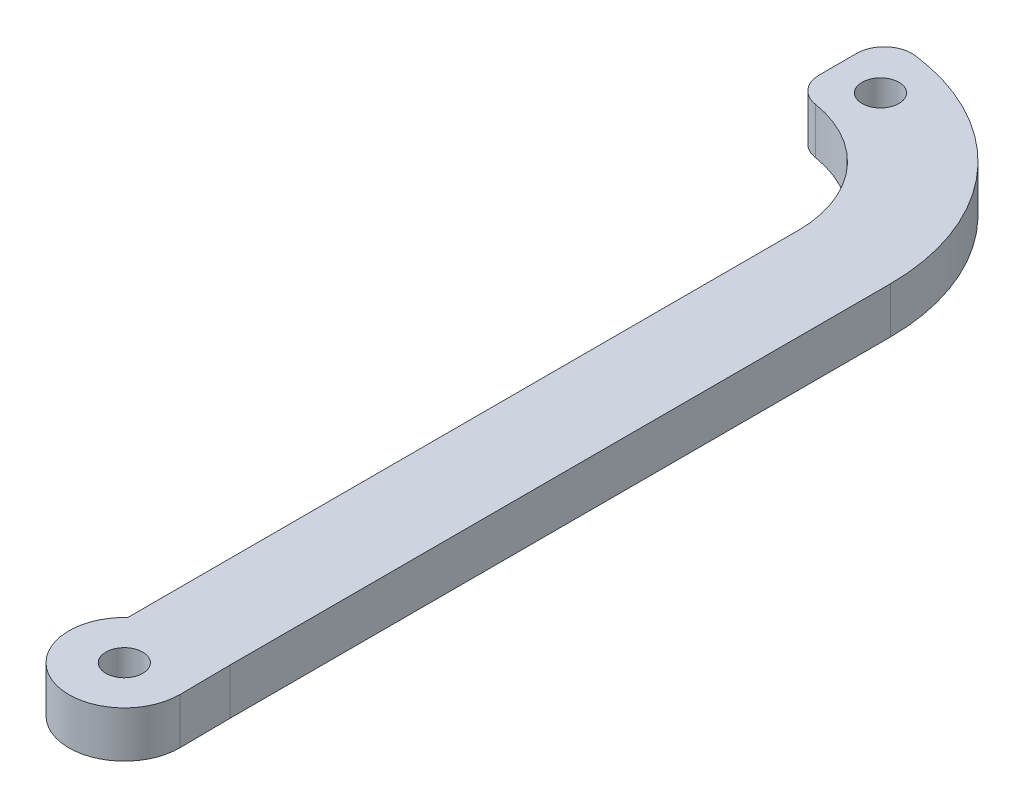
ISO-10303-21;
HEADER;
FILE_DESCRIPTION(('STEP AP214'),'2;1');
FILE_NAME('part.step','',(''),(''),'','','');
FILE_SCHEMA(('AUTOMOTIVE_DESIGN { 1 0 10303 214 1 1 1 1 }'));
ENDSEC;
DATA;
#1=APPLICATION_CONTEXT('core data for automotive mechanical design processes');
#2=APPLICATION_PROTOCOL_DEFINITION('international standard','automotive_design',2000,#1);
#3=PRODUCT_CONTEXT('',#1,'mechanical');
#4=PRODUCT('Part','Part','',(#3));
#5=PRODUCT_RELATED_PRODUCT_CATEGORY('part','',(#4));
#6=PRODUCT_DEFINITION_FORMATION('','',#4);
#7=PRODUCT_DEFINITION_CONTEXT('part definition',#1,'design');
#8=PRODUCT_DEFINITION('design','',#6,#7);
#9=PRODUCT_DEFINITION_SHAPE('','',#8);
#10=(LENGTH_UNIT() NAMED_UNIT(*) SI_UNIT(.MILLI.,.METRE.));
#11=(NAMED_UNIT(*) PLANE_ANGLE_UNIT() SI_UNIT($,.RADIAN.));
#12=(NAMED_UNIT(*) SI_UNIT($,.STERADIAN.) SOLID_ANGLE_UNIT());
#13=UNCERTAINTY_MEASURE_WITH_UNIT(LENGTH_MEASURE(1.E-05),#10,'distance_accuracy_value','');
#14=(GEOMETRIC_REPRESENTATION_CONTEXT(3) GLOBAL_UNCERTAINTY_ASSIGNED_CONTEXT((#13)) GLOBAL_UNIT_ASSIGNED_CONTEXT((#10,
#11,#12)) REPRESENTATION_CONTEXT('',''));
#15=CARTESIAN_POINT('',(0.,0.,0.));
#16=DIRECTION('',(0.,0.,1.));
#17=DIRECTION('',(1.,0.,0.));
#18=AXIS2_PLACEMENT_3D('',#15,#16,#17);
#19=CARTESIAN_POINT('',(-17.,5.,-49.1131525975226));
#20=DIRECTION('',(0.,-1.,0.));
#21=DIRECTION('',(0.,0.,-1.));
#22=AXIS2_PLACEMENT_3D('',#19,#20,#21);
#23=CYLINDRICAL_SURFACE('',#22,22.945);
#24=CARTESIAN_POINT('',(-17.,0.,-49.1131525975226));
#25=DIRECTION('',(0.,1.,0.));
#26=DIRECTION('',(0.,0.,1.));
#27=AXIS2_PLACEMENT_3D('',#24,#25,#26);
#28=CIRCLE('',#27,22.945);
#29=CARTESIAN_POINT('',(-14.1239659062422,0.,-71.8771911867435));
#30=VERTEX_POINT('',#29);
#31=CARTESIAN_POINT('',(5.94499999999996,0.,-49.1131525975226));
#32=VERTEX_POINT('',#31);
#33=EDGE_CURVE('E149',#30,#32,#28,.F.);
#34=ORIENTED_EDGE('',*,*,#33,.F.);
#35=DIRECTION('',(0.,-1.,0.));
#36=VECTOR('',#35,1.);
#37=CARTESIAN_POINT('',(-14.1239659062422,5.,-71.8771911867436));
#38=LINE('',#37,#36);
#39=CARTESIAN_POINT('',(-14.1239659062422,5.,-71.8771911867435));
#40=VERTEX_POINT('',#39);
#41=EDGE_CURVE('E11',#30,#40,#38,.F.);
#42=ORIENTED_EDGE('',*,*,#41,.T.);
#43=CARTESIAN_POINT('',(-17.,5.,-49.1131525975226));
#44=DIRECTION('',(0.,1.,0.));
#45=DIRECTION('',(0.,0.,1.));
#46=AXIS2_PLACEMENT_3D('',#43,#44,#45);
#47=CIRCLE('',#46,22.945);
#48=CARTESIAN_POINT('',(5.94499999999996,5.,-49.1131525975226));
#49=VERTEX_POINT('',#48);
#50=EDGE_CURVE('E171',#40,#49,#47,.F.);
#51=ORIENTED_EDGE('',*,*,#50,.T.);
#52=DIRECTION('',(0.,-1.,0.));
#53=VECTOR('',#52,1.);
#54=CARTESIAN_POINT('',(5.94499999999996,5.,-49.1131525975226));
#55=LINE('',#54,#53);
#56=EDGE_CURVE('E148',#49,#32,#55,.T.);
#57=ORIENTED_EDGE('',*,*,#56,.T.);
#58=EDGE_LOOP('',(#34,#42,#51,#57));
#59=FACE_BOUND('',#58,.T.);
#60=ADVANCED_FACE('F34',(#59),#23,.T.);
#61=CARTESIAN_POINT('',(-17.5,5.,0.));
#62=DIRECTION('',(1.,0.,0.));
#63=DIRECTION('',(0.,0.,-1.));
#64=AXIS2_PLACEMENT_3D('',#61,#62,#63);
#65=PLANE('',#64);
#66=DIRECTION('',(0.,0.,1.));
#67=VECTOR('',#66,1.);
#68=CARTESIAN_POINT('',(-17.5,0.,0.));
#69=LINE('',#68,#67);
#70=CARTESIAN_POINT('',(-17.5,0.,-68.9008514278565));
#71=VERTEX_POINT('',#70);
#72=CARTESIAN_POINT('',(-17.5,0.,-64.8609468875176));
#73=VERTEX_POINT('',#72);
#74=EDGE_CURVE('E151',#71,#73,#69,.T.);
#75=ORIENTED_EDGE('',*,*,#74,.T.);
#76=DIRECTION('',(0.,-1.,0.));
#77=VECTOR('',#76,1.);
#78=CARTESIAN_POINT('',(-17.5,5.,-64.8609468875176));
#79=LINE('',#78,#77);
#80=CARTESIAN_POINT('',(-17.5,5.,-64.8609468875176));
#81=VERTEX_POINT('',#80);
#82=EDGE_CURVE('E55',#73,#81,#79,.F.);
#83=ORIENTED_EDGE('',*,*,#82,.T.);
#84=DIRECTION('',(0.,0.,1.));
#85=VECTOR('',#84,1.);
#86=CARTESIAN_POINT('',(-17.5,5.,0.));
#87=LINE('',#86,#85);
#88=CARTESIAN_POINT('',(-17.5,5.,-68.9008514278565));
#89=VERTEX_POINT('',#88);
#90=EDGE_CURVE('E116',#89,#81,#87,.T.);
#91=ORIENTED_EDGE('',*,*,#90,.F.);
#92=DIRECTION('',(0.,1.,0.));
#93=VECTOR('',#92,1.);
#94=CARTESIAN_POINT('',(-17.5,0.,-68.9008514278565));
#95=LINE('',#94,#93);
#96=EDGE_CURVE('E184',#89,#71,#95,.F.);
#97=ORIENTED_EDGE('',*,*,#96,.T.);
#98=EDGE_LOOP('',(#75,#83,#91,#97));
#99=FACE_BOUND('',#98,.T.);
#100=ADVANCED_FACE('F193',(#99),#65,.F.);
#101=CARTESIAN_POINT('',(-17.,5.,-49.1131525975225));
#102=DIRECTION('',(0.,-1.,0.));
#103=DIRECTION('',(0.,0.,-1.));
#104=AXIS2_PLACEMENT_3D('',#101,#102,#103);
#105=CYLINDRICAL_SURFACE('',#104,12.945);
#106=CARTESIAN_POINT('',(-17.,5.,-49.1131525975225));
#107=DIRECTION('',(0.,1.,0.));
#108=DIRECTION('',(0.,0.,1.));
#109=AXIS2_PLACEMENT_3D('',#106,#107,#108);
#110=CIRCLE('',#109,12.945);
#111=CARTESIAN_POINT('',(-14.9703668861712,5.,-61.8980505018177));
#112=VERTEX_POINT('',#111);
#113=CARTESIAN_POINT('',(-4.05499999999999,5.,-49.1131525975225));
#114=VERTEX_POINT('',#113);
#115=EDGE_CURVE('E106',#112,#114,#110,.F.);
#116=ORIENTED_EDGE('',*,*,#115,.F.);
#117=DIRECTION('',(0.,-1.,0.));
#118=VECTOR('',#117,1.);
#119=CARTESIAN_POINT('',(-14.9703668861712,5.,-61.8980505018177));
#120=LINE('',#119,#118);
#121=CARTESIAN_POINT('',(-14.9703668861712,0.,-61.8980505018177));
#122=VERTEX_POINT('',#121);
#123=EDGE_CURVE('E126',#112,#122,#120,.T.);
#124=ORIENTED_EDGE('',*,*,#123,.T.);
#125=CARTESIAN_POINT('',(-17.,0.,-49.1131525975225));
#126=DIRECTION('',(0.,1.,0.));
#127=DIRECTION('',(0.,0.,1.));
#128=AXIS2_PLACEMENT_3D('',#125,#126,#127);
#129=CIRCLE('',#128,12.945);
#130=CARTESIAN_POINT('',(-4.05499999999999,0.,-49.1131525975225));
#131=VERTEX_POINT('',#130);
#132=EDGE_CURVE('E122',#122,#131,#129,.F.);
#133=ORIENTED_EDGE('',*,*,#132,.T.);
#134=DIRECTION('',(0.,-1.,0.));
#135=VECTOR('',#134,1.);
#136=CARTESIAN_POINT('',(-4.05499999999999,5.,-49.1131525975225));
#137=LINE('',#136,#135);
#138=EDGE_CURVE('E119',#114,#131,#137,.T.);
#139=ORIENTED_EDGE('',*,*,#138,.F.);
#140=EDGE_LOOP('',(#116,#124,#133,#139));
#141=FACE_BOUND('',#140,.T.);
#142=ADVANCED_FACE('F120',(#141),#105,.F.);
#143=CARTESIAN_POINT('',(-4.05499999999999,5.,0.));
#144=DIRECTION('',(-1.,0.,0.));
#145=DIRECTION('',(0.,0.,1.));
#146=AXIS2_PLACEMENT_3D('',#143,#144,#145);
#147=PLANE('',#146);
#148=DIRECTION('',(0.,0.,-1.));
#149=VECTOR('',#148,1.);
#150=CARTESIAN_POINT('',(-4.05499999999999,0.,0.));
#151=LINE('',#150,#149);
#152=CARTESIAN_POINT('',(-4.05499999999999,0.,23.519927529847));
#153=VERTEX_POINT('',#152);
#154=EDGE_CURVE('E154',#153,#131,#151,.T.);
#155=ORIENTED_EDGE('',*,*,#154,.F.);
#156=DIRECTION('',(0.,-1.,0.));
#157=VECTOR('',#156,1.);
#158=CARTESIAN_POINT('',(-4.05499999999999,5.,23.519927529847));
#159=LINE('',#158,#157);
#160=CARTESIAN_POINT('',(-4.05499999999999,5.,23.519927529847));
#161=VERTEX_POINT('',#160);
#162=EDGE_CURVE('E127',#161,#153,#159,.T.);
#163=ORIENTED_EDGE('',*,*,#162,.F.);
#164=DIRECTION('',(0.,0.,-1.));
#165=VECTOR('',#164,1.);
#166=CARTESIAN_POINT('',(-4.05499999999999,5.,0.));
#167=LINE('',#166,#165);
#168=EDGE_CURVE('E111',#161,#114,#167,.T.);
#169=ORIENTED_EDGE('',*,*,#168,.T.);
#170=ORIENTED_EDGE('',*,*,#138,.T.);
#171=EDGE_LOOP('',(#155,#163,#169,#170));
#172=FACE_BOUND('',#171,.T.);
#173=ADVANCED_FACE('F129',(#172),#147,.T.);
#174=CARTESIAN_POINT('',(0.,5.,27.9418474024774));
#175=DIRECTION('',(0.,-1.,0.));
#176=DIRECTION('',(0.,0.,-1.));
#177=AXIS2_PLACEMENT_3D('',#174,#175,#176);
#178=CYLINDRICAL_SURFACE('',#177,5.99970002249813);
#179=CARTESIAN_POINT('',(0.,0.,27.9418474024774));
#180=DIRECTION('',(0.,1.,0.));
#181=DIRECTION('',(0.,0.,1.));
#182=AXIS2_PLACEMENT_3D('',#179,#180,#181);
#183=CIRCLE('',#182,5.99970002249813);
#184=CARTESIAN_POINT('',(5.999400059994,0.,27.8818534018775));
#185=VERTEX_POINT('',#184);
#186=EDGE_CURVE('E156',#153,#185,#183,.T.);
#187=ORIENTED_EDGE('',*,*,#186,.T.);
#188=DIRECTION('',(0.,-1.,0.));
#189=VECTOR('',#188,1.);
#190=CARTESIAN_POINT('',(5.999400059994,5.,27.8818534018775));
#191=LINE('',#190,#189);
#192=CARTESIAN_POINT('',(5.999400059994,5.,27.8818534018775));
#193=VERTEX_POINT('',#192);
#194=EDGE_CURVE('E176',#193,#185,#191,.T.);
#195=ORIENTED_EDGE('',*,*,#194,.F.);
#196=CARTESIAN_POINT('',(0.,5.,27.9418474024774));
#197=DIRECTION('',(0.,1.,0.));
#198=DIRECTION('',(0.,0.,1.));
#199=AXIS2_PLACEMENT_3D('',#196,#197,#198);
#200=CIRCLE('',#199,5.99970002249813);
#201=EDGE_CURVE('E131',#161,#193,#200,.T.);
#202=ORIENTED_EDGE('',*,*,#201,.F.);
#203=ORIENTED_EDGE('',*,*,#162,.T.);
#204=EDGE_LOOP('',(#187,#195,#202,#203));
#205=FACE_BOUND('',#204,.T.);
#206=ADVANCED_FACE('F209',(#205),#178,.T.);
#207=CARTESIAN_POINT('',(5.72000952502252,5.,-0.0572000952502671));
#208=DIRECTION('',(0.999950003749688,0.,-0.0099995000375042));
#209=DIRECTION('',(-0.0099995000375042,0.,-0.999950003749688));
#210=AXIS2_PLACEMENT_3D('',#207,#208,#209);
#211=PLANE('',#210);
#212=DIRECTION('',(0.0099995000375042,0.,0.999950003749688));
#213=VECTOR('',#212,1.);
#214=CARTESIAN_POINT('',(5.72000952502252,0.,-0.0572000952502671));
#215=LINE('',#214,#213);
#216=CARTESIAN_POINT('',(5.94499999999996,0.,22.4418474024774));
#217=VERTEX_POINT('',#216);
#218=EDGE_CURVE('E159',#217,#185,#215,.T.);
#219=ORIENTED_EDGE('',*,*,#218,.F.);
#220=DIRECTION('',(0.,-1.,0.));
#221=VECTOR('',#220,1.);
#222=CARTESIAN_POINT('',(5.94499999999996,5.,22.4418474024774));
#223=LINE('',#222,#221);
#224=CARTESIAN_POINT('',(5.94499999999996,5.,22.4418474024774));
#225=VERTEX_POINT('',#224);
#226=EDGE_CURVE('E174',#225,#217,#223,.T.);
#227=ORIENTED_EDGE('',*,*,#226,.F.);
#228=DIRECTION('',(0.0099995000375042,0.,0.999950003749688));
#229=VECTOR('',#228,1.);
#230=CARTESIAN_POINT('',(5.72000952502252,5.,-0.0572000952502671));
#231=LINE('',#230,#229);
#232=EDGE_CURVE('E133',#225,#193,#231,.T.);
#233=ORIENTED_EDGE('',*,*,#232,.T.);
#234=ORIENTED_EDGE('',*,*,#194,.T.);
#235=EDGE_LOOP('',(#219,#227,#233,#234));
#236=FACE_BOUND('',#235,.T.);
#237=ADVANCED_FACE('F205',(#236),#211,.T.);
#238=CARTESIAN_POINT('',(0.,5.,27.9418474024774));
#239=DIRECTION('',(0.,-1.,0.));
#240=DIRECTION('',(0.,0.,-1.));
#241=AXIS2_PLACEMENT_3D('',#238,#239,#240);
#242=CYLINDRICAL_SURFACE('',#241,2.);
#243=CARTESIAN_POINT('',(0.,5.,27.9418474024774));
#244=DIRECTION('',(0.,1.,0.));
#245=DIRECTION('',(0.,0.,1.));
#246=AXIS2_PLACEMENT_3D('',#243,#244,#245);
#247=CIRCLE('',#246,2.);
#248=CARTESIAN_POINT('',(0.,5.,29.9418474024774));
#249=VERTEX_POINT('',#248);
#250=EDGE_CURVE('E142',#249,#249,#247,.T.);
#251=ORIENTED_EDGE('',*,*,#250,.T.);
#252=EDGE_LOOP('',(#251));
#253=FACE_BOUND('',#252,.T.);
#254=CARTESIAN_POINT('',(0.,0.,27.9418474024774));
#255=DIRECTION('',(0.,1.,0.));
#256=DIRECTION('',(0.,0.,1.));
#257=AXIS2_PLACEMENT_3D('',#254,#255,#256);
#258=CIRCLE('',#257,2.);
#259=CARTESIAN_POINT('',(0.,0.,29.9418474024774));
#260=VERTEX_POINT('',#259);
#261=EDGE_CURVE('E165',#260,#260,#258,.T.);
#262=ORIENTED_EDGE('',*,*,#261,.F.);
#263=EDGE_LOOP('',(#262));
#264=FACE_BOUND('',#263,.T.);
#265=ADVANCED_FACE('F216',(#253,#264),#242,.F.);
#266=CARTESIAN_POINT('',(5.94499999999996,5.,0.));
#267=DIRECTION('',(1.,0.,0.));
#268=DIRECTION('',(0.,0.,-1.));
#269=AXIS2_PLACEMENT_3D('',#266,#267,#268);
#270=PLANE('',#269);
#271=DIRECTION('',(0.,0.,1.));
#272=VECTOR('',#271,1.);
#273=CARTESIAN_POINT('',(5.94499999999996,0.,0.));
#274=LINE('',#273,#272);
#275=EDGE_CURVE('E162',#32,#217,#274,.T.);
#276=ORIENTED_EDGE('',*,*,#275,.F.);
#277=ORIENTED_EDGE('',*,*,#56,.F.);
#278=DIRECTION('',(0.,0.,1.));
#279=VECTOR('',#278,1.);
#280=CARTESIAN_POINT('',(5.94499999999996,5.,0.));
#281=LINE('',#280,#279);
#282=EDGE_CURVE('E139',#49,#225,#281,.T.);
#283=ORIENTED_EDGE('',*,*,#282,.T.);
#284=ORIENTED_EDGE('',*,*,#226,.T.);
#285=EDGE_LOOP('',(#276,#277,#283,#284));
#286=FACE_BOUND('',#285,.T.);
#287=ADVANCED_FACE('F201',(#286),#270,.T.);
#288=CARTESIAN_POINT('',(-12.5,5.,-66.4919622518113));
#289=DIRECTION('',(0.,-1.,0.));
#290=DIRECTION('',(0.,0.,-1.));
#291=AXIS2_PLACEMENT_3D('',#288,#289,#290);
#292=CYLINDRICAL_SURFACE('',#291,2.);
#293=CARTESIAN_POINT('',(-12.5,5.,-66.4919622518113));
#294=DIRECTION('',(0.,1.,0.));
#295=DIRECTION('',(0.,0.,1.));
#296=AXIS2_PLACEMENT_3D('',#293,#294,#295);
#297=CIRCLE('',#296,2.);
#298=CARTESIAN_POINT('',(-12.5,5.,-64.4919622518113));
#299=VERTEX_POINT('',#298);
#300=EDGE_CURVE('E145',#299,#299,#297,.T.);
#301=ORIENTED_EDGE('',*,*,#300,.T.);
#302=EDGE_LOOP('',(#301));
#303=FACE_BOUND('',#302,.T.);
#304=CARTESIAN_POINT('',(-12.5,0.,-66.4919622518113));
#305=DIRECTION('',(0.,1.,0.));
#306=DIRECTION('',(0.,0.,1.));
#307=AXIS2_PLACEMENT_3D('',#304,#305,#306);
#308=CIRCLE('',#307,2.);
#309=CARTESIAN_POINT('',(-12.5,0.,-64.4919622518113));
#310=VERTEX_POINT('',#309);
#311=EDGE_CURVE('E168',#310,#310,#308,.T.);
#312=ORIENTED_EDGE('',*,*,#311,.F.);
#313=EDGE_LOOP('',(#312));
#314=FACE_BOUND('',#313,.T.);
#315=ADVANCED_FACE('F237',(#303,#314),#292,.F.);
#316=CARTESIAN_POINT('',(0.,5.,0.));
#317=DIRECTION('',(0.,1.,0.));
#318=DIRECTION('',(0.,0.,1.));
#319=AXIS2_PLACEMENT_3D('',#316,#317,#318);
#320=PLANE('',#319);
#321=ORIENTED_EDGE('',*,*,#90,.T.);
#322=CARTESIAN_POINT('',(-14.5,5.,-64.8609468875176));
#323=DIRECTION('',(0.,1.,0.));
#324=DIRECTION('',(0.,0.,1.));
#325=AXIS2_PLACEMENT_3D('',#322,#323,#324);
#326=CIRCLE('',#325,3.);
#327=EDGE_CURVE('E42',#81,#112,#326,.T.);
#328=ORIENTED_EDGE('',*,*,#327,.T.);
#329=ORIENTED_EDGE('',*,*,#115,.T.);
#330=ORIENTED_EDGE('',*,*,#168,.F.);
#331=ORIENTED_EDGE('',*,*,#201,.T.);
#332=ORIENTED_EDGE('',*,*,#232,.F.);
#333=ORIENTED_EDGE('',*,*,#282,.F.);
#334=ORIENTED_EDGE('',*,*,#50,.F.);
#335=CARTESIAN_POINT('',(-14.5,5.,-68.9008514278565));
#336=DIRECTION('',(0.,1.,0.));
#337=DIRECTION('',(0.,0.,1.));
#338=AXIS2_PLACEMENT_3D('',#335,#336,#337);
#339=CIRCLE('',#338,3.);
#340=EDGE_CURVE('E188',#40,#89,#339,.T.);
#341=ORIENTED_EDGE('',*,*,#340,.T.);
#342=EDGE_LOOP('',(#321,#328,#329,#330,#331,#332,#333,#334,#341));
#343=FACE_BOUND('',#342,.T.);
#344=ORIENTED_EDGE('',*,*,#250,.F.);
#345=EDGE_LOOP('',(#344));
#346=FACE_BOUND('',#345,.T.);
#347=ORIENTED_EDGE('',*,*,#300,.F.);
#348=EDGE_LOOP('',(#347));
#349=FACE_BOUND('',#348,.T.);
#350=ADVANCED_FACE('F108',(#343,#346,#349),#320,.T.);
#351=CARTESIAN_POINT('',(0.,0.,0.));
#352=DIRECTION('',(0.,1.,0.));
#353=DIRECTION('',(0.,0.,1.));
#354=AXIS2_PLACEMENT_3D('',#351,#352,#353);
#355=PLANE('',#354);
#356=ORIENTED_EDGE('',*,*,#132,.F.);
#357=CARTESIAN_POINT('',(-14.5,0.,-64.8609468875176));
#358=DIRECTION('',(0.,1.,0.));
#359=DIRECTION('',(0.,0.,1.));
#360=AXIS2_PLACEMENT_3D('',#357,#358,#359);
#361=CIRCLE('',#360,3.);
#362=EDGE_CURVE('E182',#122,#73,#361,.F.);
#363=ORIENTED_EDGE('',*,*,#362,.T.);
#364=ORIENTED_EDGE('',*,*,#74,.F.);
#365=CARTESIAN_POINT('',(-14.5,0.,-68.9008514278565));
#366=DIRECTION('',(0.,1.,0.));
#367=DIRECTION('',(0.,0.,1.));
#368=AXIS2_PLACEMENT_3D('',#365,#366,#367);
#369=CIRCLE('',#368,3.);
#370=EDGE_CURVE('E180',#71,#30,#369,.F.);
#371=ORIENTED_EDGE('',*,*,#370,.T.);
#372=ORIENTED_EDGE('',*,*,#33,.T.);
#373=ORIENTED_EDGE('',*,*,#275,.T.);
#374=ORIENTED_EDGE('',*,*,#218,.T.);
#375=ORIENTED_EDGE('',*,*,#186,.F.);
#376=ORIENTED_EDGE('',*,*,#154,.T.);
#377=EDGE_LOOP('',(#356,#363,#364,#371,#372,#373,#374,#375,#376));
#378=FACE_BOUND('',#377,.T.);
#379=ORIENTED_EDGE('',*,*,#261,.T.);
#380=EDGE_LOOP('',(#379));
#381=FACE_BOUND('',#380,.T.);
#382=ORIENTED_EDGE('',*,*,#311,.T.);
#383=EDGE_LOOP('',(#382));
#384=FACE_BOUND('',#383,.T.);
#385=ADVANCED_FACE('F196',(#378,#381,#384),#355,.F.);
#386=CARTESIAN_POINT('',(-14.5,5.,-64.8609468875176));
#387=DIRECTION('',(0.,-1.,0.));
#388=DIRECTION('',(0.,0.,-1.));
#389=AXIS2_PLACEMENT_3D('',#386,#387,#388);
#390=CYLINDRICAL_SURFACE('',#389,3.);
#391=ORIENTED_EDGE('',*,*,#327,.F.);
#392=ORIENTED_EDGE('',*,*,#82,.F.);
#393=ORIENTED_EDGE('',*,*,#362,.F.);
#394=ORIENTED_EDGE('',*,*,#123,.F.);
#395=EDGE_LOOP('',(#391,#392,#393,#394));
#396=FACE_BOUND('',#395,.T.);
#397=ADVANCED_FACE('F226',(#396),#390,.T.);
#398=CARTESIAN_POINT('',(-14.5,5.,-68.9008514278565));
#399=DIRECTION('',(0.,-1.,0.));
#400=DIRECTION('',(0.,0.,-1.));
#401=AXIS2_PLACEMENT_3D('',#398,#399,#400);
#402=CYLINDRICAL_SURFACE('',#401,3.);
#403=ORIENTED_EDGE('',*,*,#340,.F.);
#404=ORIENTED_EDGE('',*,*,#41,.F.);
#405=ORIENTED_EDGE('',*,*,#370,.F.);
#406=ORIENTED_EDGE('',*,*,#96,.F.);
#407=EDGE_LOOP('',(#403,#404,#405,#406));
#408=FACE_BOUND('',#407,.T.);
#409=ADVANCED_FACE('F36',(#408),#402,.T.);
#410=CLOSED_SHELL('',(#60,#100,#142,#173,#206,#237,#265,#287,#315,#350,#385,#397,#409));
#411=MANIFOLD_SOLID_BREP('B2',#410);
#412=ADVANCED_BREP_SHAPE_REPRESENTATION('',(#18,#411),#14);
#413=SHAPE_DEFINITION_REPRESENTATION(#9,#412);
ENDSEC;
END-ISO-10303-21;
